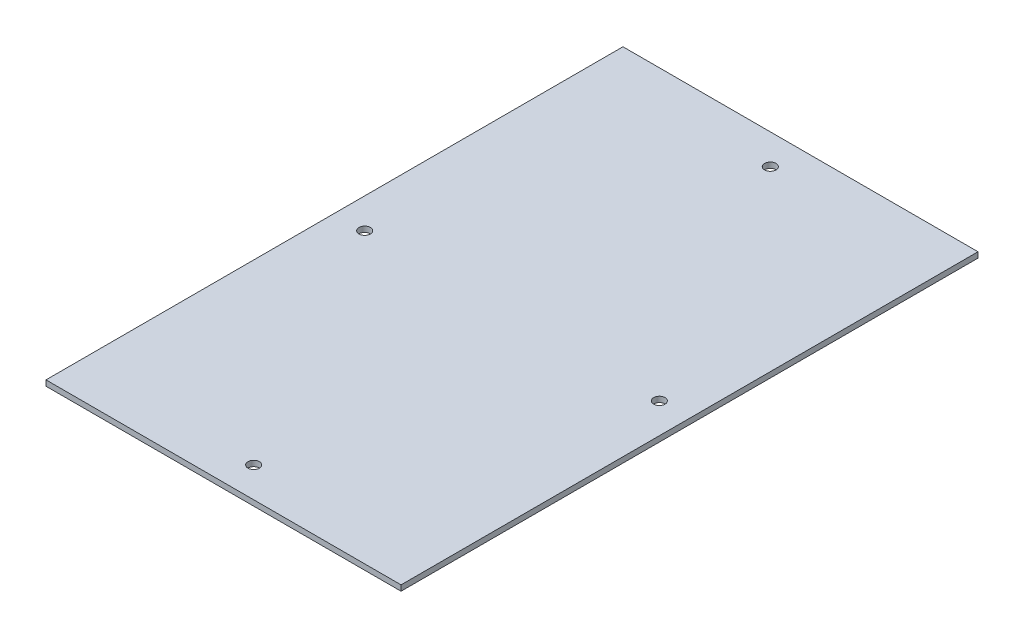
ISO-10303-21;
HEADER;
FILE_DESCRIPTION(('STEP AP214'),'2;1');
FILE_NAME('part.step','',(''),(''),'','','');
FILE_SCHEMA(('AUTOMOTIVE_DESIGN { 1 0 10303 214 1 1 1 1 }'));
ENDSEC;
DATA;
#1=APPLICATION_CONTEXT('core data for automotive mechanical design processes');
#2=APPLICATION_PROTOCOL_DEFINITION('international standard','automotive_design',2000,#1);
#3=PRODUCT_CONTEXT('',#1,'mechanical');
#4=PRODUCT('Part','Part','',(#3));
#5=PRODUCT_RELATED_PRODUCT_CATEGORY('part','',(#4));
#6=PRODUCT_DEFINITION_FORMATION('','',#4);
#7=PRODUCT_DEFINITION_CONTEXT('part definition',#1,'design');
#8=PRODUCT_DEFINITION('design','',#6,#7);
#9=PRODUCT_DEFINITION_SHAPE('','',#8);
#10=(LENGTH_UNIT() NAMED_UNIT(*) SI_UNIT(.MILLI.,.METRE.));
#11=(NAMED_UNIT(*) PLANE_ANGLE_UNIT() SI_UNIT($,.RADIAN.));
#12=(NAMED_UNIT(*) SI_UNIT($,.STERADIAN.) SOLID_ANGLE_UNIT());
#13=UNCERTAINTY_MEASURE_WITH_UNIT(LENGTH_MEASURE(1.E-05),#10,'distance_accuracy_value','');
#14=(GEOMETRIC_REPRESENTATION_CONTEXT(3) GLOBAL_UNCERTAINTY_ASSIGNED_CONTEXT((#13)) GLOBAL_UNIT_ASSIGNED_CONTEXT((#10,
#11,#12)) REPRESENTATION_CONTEXT('',''));
#15=CARTESIAN_POINT('',(0.,0.,0.));
#16=DIRECTION('',(0.,0.,1.));
#17=DIRECTION('',(1.,0.,0.));
#18=AXIS2_PLACEMENT_3D('',#15,#16,#17);
#19=CARTESIAN_POINT('',(0.,3.175,0.));
#20=DIRECTION('',(0.,1.,0.));
#21=DIRECTION('',(0.,0.,1.));
#22=AXIS2_PLACEMENT_3D('',#19,#20,#21);
#23=PLANE('',#22);
#24=CARTESIAN_POINT('',(101.6,3.175,312.928));
#25=DIRECTION('',(0.,1.,0.));
#26=DIRECTION('',(0.,0.,1.));
#27=AXIS2_PLACEMENT_3D('',#24,#25,#26);
#28=CIRCLE('',#27,3.2639);
#29=CARTESIAN_POINT('',(101.6,3.175,316.1919));
#30=VERTEX_POINT('',#29);
#31=EDGE_CURVE('E124',#30,#30,#28,.T.);
#32=ORIENTED_EDGE('',*,*,#31,.F.);
#33=EDGE_LOOP('',(#32));
#34=FACE_BOUND('',#33,.T.);
#35=CARTESIAN_POINT('',(17.272,3.175,165.1));
#36=DIRECTION('',(0.,1.,0.));
#37=DIRECTION('',(0.,0.,1.));
#38=AXIS2_PLACEMENT_3D('',#35,#36,#37);
#39=CIRCLE('',#38,3.2639);
#40=CARTESIAN_POINT('',(17.272,3.175,168.3639));
#41=VERTEX_POINT('',#40);
#42=EDGE_CURVE('E103',#41,#41,#39,.T.);
#43=ORIENTED_EDGE('',*,*,#42,.F.);
#44=EDGE_LOOP('',(#43));
#45=FACE_BOUND('',#44,.T.);
#46=DIRECTION('',(0.,0.,1.));
#47=VECTOR('',#46,1.);
#48=CARTESIAN_POINT('',(0.,3.175,0.));
#49=LINE('',#48,#47);
#50=CARTESIAN_POINT('',(0.,3.175,0.));
#51=VERTEX_POINT('',#50);
#52=CARTESIAN_POINT('',(0.,3.175,330.2));
#53=VERTEX_POINT('',#52);
#54=EDGE_CURVE('E88',#51,#53,#49,.T.);
#55=ORIENTED_EDGE('',*,*,#54,.T.);
#56=DIRECTION('',(1.,0.,0.));
#57=VECTOR('',#56,1.);
#58=CARTESIAN_POINT('',(0.,3.175,330.2));
#59=LINE('',#58,#57);
#60=CARTESIAN_POINT('',(203.2,3.175,330.2));
#61=VERTEX_POINT('',#60);
#62=EDGE_CURVE('E83',#53,#61,#59,.T.);
#63=ORIENTED_EDGE('',*,*,#62,.T.);
#64=DIRECTION('',(0.,0.,-1.));
#65=VECTOR('',#64,1.);
#66=CARTESIAN_POINT('',(203.2,3.175,0.));
#67=LINE('',#66,#65);
#68=CARTESIAN_POINT('',(203.2,3.175,0.));
#69=VERTEX_POINT('',#68);
#70=EDGE_CURVE('E86',#61,#69,#67,.T.);
#71=ORIENTED_EDGE('',*,*,#70,.T.);
#72=DIRECTION('',(-1.,0.,0.));
#73=VECTOR('',#72,1.);
#74=CARTESIAN_POINT('',(0.,3.175,0.));
#75=LINE('',#74,#73);
#76=EDGE_CURVE('E53',#69,#51,#75,.T.);
#77=ORIENTED_EDGE('',*,*,#76,.T.);
#78=EDGE_LOOP('',(#55,#63,#71,#77));
#79=FACE_BOUND('',#78,.T.);
#80=CARTESIAN_POINT('',(101.6,3.175,17.272));
#81=DIRECTION('',(0.,1.,0.));
#82=DIRECTION('',(0.,0.,1.));
#83=AXIS2_PLACEMENT_3D('',#80,#81,#82);
#84=CIRCLE('',#83,3.26389999999999);
#85=CARTESIAN_POINT('',(101.6,3.175,20.5359));
#86=VERTEX_POINT('',#85);
#87=EDGE_CURVE('E118',#86,#86,#84,.T.);
#88=ORIENTED_EDGE('',*,*,#87,.F.);
#89=EDGE_LOOP('',(#88));
#90=FACE_BOUND('',#89,.T.);
#91=CARTESIAN_POINT('',(185.928,3.175,165.1));
#92=DIRECTION('',(0.,1.,0.));
#93=DIRECTION('',(0.,0.,1.));
#94=AXIS2_PLACEMENT_3D('',#91,#92,#93);
#95=CIRCLE('',#94,3.26389999999998);
#96=CARTESIAN_POINT('',(185.928,3.175,168.3639));
#97=VERTEX_POINT('',#96);
#98=EDGE_CURVE('E130',#97,#97,#95,.T.);
#99=ORIENTED_EDGE('',*,*,#98,.F.);
#100=EDGE_LOOP('',(#99));
#101=FACE_BOUND('',#100,.T.);
#102=ADVANCED_FACE('F36',(#34,#45,#79,#90,#101),#23,.T.);
#103=CARTESIAN_POINT('',(0.,0.,0.));
#104=DIRECTION('',(0.,1.,0.));
#105=DIRECTION('',(0.,0.,1.));
#106=AXIS2_PLACEMENT_3D('',#103,#104,#105);
#107=PLANE('',#106);
#108=DIRECTION('',(0.,0.,1.));
#109=VECTOR('',#108,1.);
#110=CARTESIAN_POINT('',(0.,0.,0.));
#111=LINE('',#110,#109);
#112=CARTESIAN_POINT('',(0.,0.,0.));
#113=VERTEX_POINT('',#112);
#114=CARTESIAN_POINT('',(0.,0.,330.2));
#115=VERTEX_POINT('',#114);
#116=EDGE_CURVE('E100',#113,#115,#111,.T.);
#117=ORIENTED_EDGE('',*,*,#116,.F.);
#118=DIRECTION('',(-1.,0.,0.));
#119=VECTOR('',#118,1.);
#120=CARTESIAN_POINT('',(0.,0.,0.));
#121=LINE('',#120,#119);
#122=CARTESIAN_POINT('',(203.2,0.,0.));
#123=VERTEX_POINT('',#122);
#124=EDGE_CURVE('E76',#123,#113,#121,.T.);
#125=ORIENTED_EDGE('',*,*,#124,.F.);
#126=DIRECTION('',(0.,0.,-1.));
#127=VECTOR('',#126,1.);
#128=CARTESIAN_POINT('',(203.2,0.,0.));
#129=LINE('',#128,#127);
#130=CARTESIAN_POINT('',(203.2,0.,330.2));
#131=VERTEX_POINT('',#130);
#132=EDGE_CURVE('E70',#131,#123,#129,.T.);
#133=ORIENTED_EDGE('',*,*,#132,.F.);
#134=DIRECTION('',(1.,0.,0.));
#135=VECTOR('',#134,1.);
#136=CARTESIAN_POINT('',(0.,0.,330.2));
#137=LINE('',#136,#135);
#138=EDGE_CURVE('E92',#115,#131,#137,.T.);
#139=ORIENTED_EDGE('',*,*,#138,.F.);
#140=EDGE_LOOP('',(#117,#125,#133,#139));
#141=FACE_BOUND('',#140,.T.);
#142=CARTESIAN_POINT('',(17.272,0.,165.1));
#143=DIRECTION('',(0.,1.,0.));
#144=DIRECTION('',(0.,0.,1.));
#145=AXIS2_PLACEMENT_3D('',#142,#143,#144);
#146=CIRCLE('',#145,3.2639);
#147=CARTESIAN_POINT('',(17.272,0.,168.3639));
#148=VERTEX_POINT('',#147);
#149=EDGE_CURVE('E115',#148,#148,#146,.T.);
#150=ORIENTED_EDGE('',*,*,#149,.T.);
#151=EDGE_LOOP('',(#150));
#152=FACE_BOUND('',#151,.T.);
#153=CARTESIAN_POINT('',(101.6,0.,17.272));
#154=DIRECTION('',(0.,1.,0.));
#155=DIRECTION('',(0.,0.,1.));
#156=AXIS2_PLACEMENT_3D('',#153,#154,#155);
#157=CIRCLE('',#156,3.26389999999999);
#158=CARTESIAN_POINT('',(101.6,0.,20.5359));
#159=VERTEX_POINT('',#158);
#160=EDGE_CURVE('E121',#159,#159,#157,.T.);
#161=ORIENTED_EDGE('',*,*,#160,.T.);
#162=EDGE_LOOP('',(#161));
#163=FACE_BOUND('',#162,.T.);
#164=CARTESIAN_POINT('',(101.6,0.,312.928));
#165=DIRECTION('',(0.,1.,0.));
#166=DIRECTION('',(0.,0.,1.));
#167=AXIS2_PLACEMENT_3D('',#164,#165,#166);
#168=CIRCLE('',#167,3.2639);
#169=CARTESIAN_POINT('',(101.6,0.,316.1919));
#170=VERTEX_POINT('',#169);
#171=EDGE_CURVE('E127',#170,#170,#168,.T.);
#172=ORIENTED_EDGE('',*,*,#171,.T.);
#173=EDGE_LOOP('',(#172));
#174=FACE_BOUND('',#173,.T.);
#175=CARTESIAN_POINT('',(185.928,0.,165.1));
#176=DIRECTION('',(0.,1.,0.));
#177=DIRECTION('',(0.,0.,1.));
#178=AXIS2_PLACEMENT_3D('',#175,#176,#177);
#179=CIRCLE('',#178,3.26389999999998);
#180=CARTESIAN_POINT('',(185.928,0.,168.3639));
#181=VERTEX_POINT('',#180);
#182=EDGE_CURVE('E133',#181,#181,#179,.T.);
#183=ORIENTED_EDGE('',*,*,#182,.T.);
#184=EDGE_LOOP('',(#183));
#185=FACE_BOUND('',#184,.T.);
#186=ADVANCED_FACE('F111',(#141,#152,#163,#174,#185),#107,.F.);
#187=CARTESIAN_POINT('',(0.,3.175,0.));
#188=DIRECTION('',(1.,0.,0.));
#189=DIRECTION('',(0.,0.,-1.));
#190=AXIS2_PLACEMENT_3D('',#187,#188,#189);
#191=PLANE('',#190);
#192=ORIENTED_EDGE('',*,*,#116,.T.);
#193=DIRECTION('',(0.,-1.,0.));
#194=VECTOR('',#193,1.);
#195=CARTESIAN_POINT('',(0.,3.175,330.2));
#196=LINE('',#195,#194);
#197=EDGE_CURVE('E11',#53,#115,#196,.T.);
#198=ORIENTED_EDGE('',*,*,#197,.F.);
#199=ORIENTED_EDGE('',*,*,#54,.F.);
#200=DIRECTION('',(0.,-1.,0.));
#201=VECTOR('',#200,1.);
#202=CARTESIAN_POINT('',(0.,3.175,0.));
#203=LINE('',#202,#201);
#204=EDGE_CURVE('E96',#51,#113,#203,.T.);
#205=ORIENTED_EDGE('',*,*,#204,.T.);
#206=EDGE_LOOP('',(#192,#198,#199,#205));
#207=FACE_BOUND('',#206,.T.);
#208=ADVANCED_FACE('F38',(#207),#191,.F.);
#209=CARTESIAN_POINT('',(0.,3.175,330.2));
#210=DIRECTION('',(0.,0.,-1.));
#211=DIRECTION('',(-1.,0.,0.));
#212=AXIS2_PLACEMENT_3D('',#209,#210,#211);
#213=PLANE('',#212);
#214=ORIENTED_EDGE('',*,*,#138,.T.);
#215=DIRECTION('',(0.,-1.,0.));
#216=VECTOR('',#215,1.);
#217=CARTESIAN_POINT('',(203.2,3.175,330.2));
#218=LINE('',#217,#216);
#219=EDGE_CURVE('E45',#61,#131,#218,.T.);
#220=ORIENTED_EDGE('',*,*,#219,.F.);
#221=ORIENTED_EDGE('',*,*,#62,.F.);
#222=ORIENTED_EDGE('',*,*,#197,.T.);
#223=EDGE_LOOP('',(#214,#220,#221,#222));
#224=FACE_BOUND('',#223,.T.);
#225=ADVANCED_FACE('F91',(#224),#213,.F.);
#226=CARTESIAN_POINT('',(203.2,3.175,0.));
#227=DIRECTION('',(-1.,0.,0.));
#228=DIRECTION('',(0.,0.,1.));
#229=AXIS2_PLACEMENT_3D('',#226,#227,#228);
#230=PLANE('',#229);
#231=ORIENTED_EDGE('',*,*,#132,.T.);
#232=DIRECTION('',(0.,-1.,0.));
#233=VECTOR('',#232,1.);
#234=CARTESIAN_POINT('',(203.2,3.175,0.));
#235=LINE('',#234,#233);
#236=EDGE_CURVE('E93',#69,#123,#235,.T.);
#237=ORIENTED_EDGE('',*,*,#236,.F.);
#238=ORIENTED_EDGE('',*,*,#70,.F.);
#239=ORIENTED_EDGE('',*,*,#219,.T.);
#240=EDGE_LOOP('',(#231,#237,#238,#239));
#241=FACE_BOUND('',#240,.T.);
#242=ADVANCED_FACE('F94',(#241),#230,.F.);
#243=CARTESIAN_POINT('',(0.,3.175,0.));
#244=DIRECTION('',(0.,0.,1.));
#245=DIRECTION('',(1.,0.,0.));
#246=AXIS2_PLACEMENT_3D('',#243,#244,#245);
#247=PLANE('',#246);
#248=ORIENTED_EDGE('',*,*,#124,.T.);
#249=ORIENTED_EDGE('',*,*,#204,.F.);
#250=ORIENTED_EDGE('',*,*,#76,.F.);
#251=ORIENTED_EDGE('',*,*,#236,.T.);
#252=EDGE_LOOP('',(#248,#249,#250,#251));
#253=FACE_BOUND('',#252,.T.);
#254=ADVANCED_FACE('F108',(#253),#247,.F.);
#255=CARTESIAN_POINT('',(17.272,3.175,165.1));
#256=DIRECTION('',(0.,-1.,0.));
#257=DIRECTION('',(0.,0.,-1.));
#258=AXIS2_PLACEMENT_3D('',#255,#256,#257);
#259=CYLINDRICAL_SURFACE('',#258,3.2639);
#260=ORIENTED_EDGE('',*,*,#42,.T.);
#261=EDGE_LOOP('',(#260));
#262=FACE_BOUND('',#261,.T.);
#263=ORIENTED_EDGE('',*,*,#149,.F.);
#264=EDGE_LOOP('',(#263));
#265=FACE_BOUND('',#264,.T.);
#266=ADVANCED_FACE('F152',(#262,#265),#259,.F.);
#267=CARTESIAN_POINT('',(101.6,3.175,17.272));
#268=DIRECTION('',(0.,-1.,0.));
#269=DIRECTION('',(0.,0.,-1.));
#270=AXIS2_PLACEMENT_3D('',#267,#268,#269);
#271=CYLINDRICAL_SURFACE('',#270,3.26389999999999);
#272=ORIENTED_EDGE('',*,*,#87,.T.);
#273=EDGE_LOOP('',(#272));
#274=FACE_BOUND('',#273,.T.);
#275=ORIENTED_EDGE('',*,*,#160,.F.);
#276=EDGE_LOOP('',(#275));
#277=FACE_BOUND('',#276,.T.);
#278=ADVANCED_FACE('F198',(#274,#277),#271,.F.);
#279=CARTESIAN_POINT('',(101.6,3.175,312.928));
#280=DIRECTION('',(0.,-1.,0.));
#281=DIRECTION('',(0.,0.,-1.));
#282=AXIS2_PLACEMENT_3D('',#279,#280,#281);
#283=CYLINDRICAL_SURFACE('',#282,3.2639);
#284=ORIENTED_EDGE('',*,*,#31,.T.);
#285=EDGE_LOOP('',(#284));
#286=FACE_BOUND('',#285,.T.);
#287=ORIENTED_EDGE('',*,*,#171,.F.);
#288=EDGE_LOOP('',(#287));
#289=FACE_BOUND('',#288,.T.);
#290=ADVANCED_FACE('F206',(#286,#289),#283,.F.);
#291=CARTESIAN_POINT('',(185.928,3.175,165.1));
#292=DIRECTION('',(0.,-1.,0.));
#293=DIRECTION('',(0.,0.,-1.));
#294=AXIS2_PLACEMENT_3D('',#291,#292,#293);
#295=CYLINDRICAL_SURFACE('',#294,3.26389999999998);
#296=ORIENTED_EDGE('',*,*,#98,.T.);
#297=EDGE_LOOP('',(#296));
#298=FACE_BOUND('',#297,.T.);
#299=ORIENTED_EDGE('',*,*,#182,.F.);
#300=EDGE_LOOP('',(#299));
#301=FACE_BOUND('',#300,.T.);
#302=ADVANCED_FACE('F139',(#298,#301),#295,.F.);
#303=CLOSED_SHELL('',(#102,#186,#208,#225,#242,#254,#266,#278,#290,#302));
#304=MANIFOLD_SOLID_BREP('B2',#303);
#305=ADVANCED_BREP_SHAPE_REPRESENTATION('',(#18,#304),#14);
#306=SHAPE_DEFINITION_REPRESENTATION(#9,#305);
ENDSEC;
END-ISO-10303-21;
